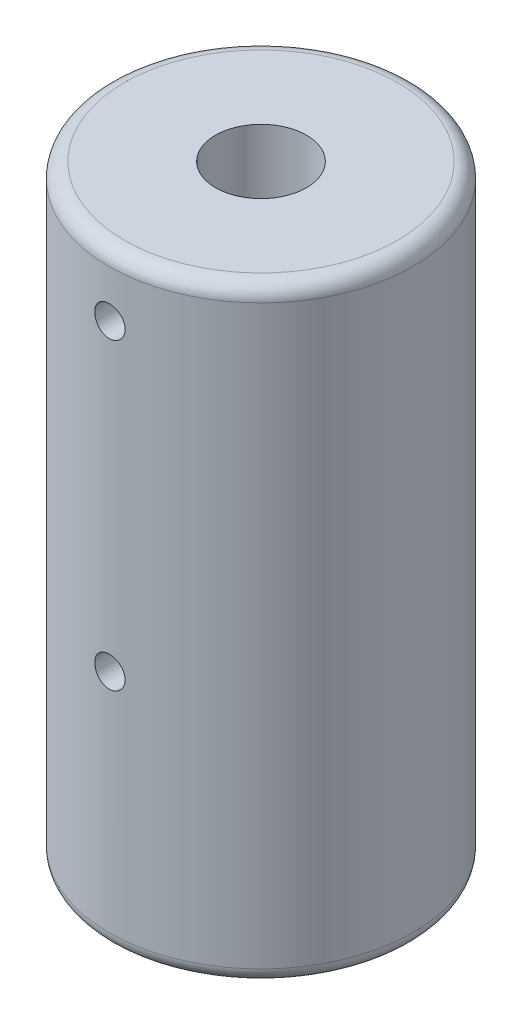
ISO-10303-21;
HEADER;
FILE_DESCRIPTION(('STEP AP214'),'2;1');
FILE_NAME('part.step','',(''),(''),'','','');
FILE_SCHEMA(('AUTOMOTIVE_DESIGN { 1 0 10303 214 1 1 1 1 }'));
ENDSEC;
DATA;
#1=APPLICATION_CONTEXT('core data for automotive mechanical design processes');
#2=APPLICATION_PROTOCOL_DEFINITION('international standard','automotive_design',2000,#1);
#3=PRODUCT_CONTEXT('',#1,'mechanical');
#4=PRODUCT('Part','Part','',(#3));
#5=PRODUCT_RELATED_PRODUCT_CATEGORY('part','',(#4));
#6=PRODUCT_DEFINITION_FORMATION('','',#4);
#7=PRODUCT_DEFINITION_CONTEXT('part definition',#1,'design');
#8=PRODUCT_DEFINITION('design','',#6,#7);
#9=PRODUCT_DEFINITION_SHAPE('','',#8);
#10=(LENGTH_UNIT() NAMED_UNIT(*) SI_UNIT(.MILLI.,.METRE.));
#11=(NAMED_UNIT(*) PLANE_ANGLE_UNIT() SI_UNIT($,.RADIAN.));
#12=(NAMED_UNIT(*) SI_UNIT($,.STERADIAN.) SOLID_ANGLE_UNIT());
#13=UNCERTAINTY_MEASURE_WITH_UNIT(LENGTH_MEASURE(1.E-05),#10,'distance_accuracy_value','');
#14=(GEOMETRIC_REPRESENTATION_CONTEXT(3) GLOBAL_UNCERTAINTY_ASSIGNED_CONTEXT((#13)) GLOBAL_UNIT_ASSIGNED_CONTEXT((#10,
#11,#12)) REPRESENTATION_CONTEXT('',''));
#15=CARTESIAN_POINT('',(0.,0.,0.));
#16=DIRECTION('',(0.,0.,1.));
#17=DIRECTION('',(1.,0.,0.));
#18=AXIS2_PLACEMENT_3D('',#15,#16,#17);
#19=CARTESIAN_POINT('',(0.,1.,0.));
#20=DIRECTION('',(0.,1.,0.));
#21=DIRECTION('',(0.,0.,1.));
#22=AXIS2_PLACEMENT_3D('',#19,#20,#21);
#23=TOROIDAL_SURFACE('',#22,9.,1.);
#24=CARTESIAN_POINT('',(0.,1.,0.));
#25=DIRECTION('',(0.,1.,0.));
#26=DIRECTION('',(0.,0.,1.));
#27=AXIS2_PLACEMENT_3D('',#24,#25,#26);
#28=CIRCLE('',#27,10.);
#29=CARTESIAN_POINT('',(0.,1.,10.));
#30=VERTEX_POINT('',#29);
#31=EDGE_CURVE('E39',#30,#30,#28,.T.);
#32=ORIENTED_EDGE('',*,*,#31,.F.);
#33=EDGE_LOOP('',(#32));
#34=FACE_BOUND('',#33,.T.);
#35=CARTESIAN_POINT('',(0.,0.,0.));
#36=DIRECTION('',(0.,1.,0.));
#37=DIRECTION('',(0.,0.,1.));
#38=AXIS2_PLACEMENT_3D('',#35,#36,#37);
#39=CIRCLE('',#38,9.);
#40=CARTESIAN_POINT('',(0.,0.,9.));
#41=VERTEX_POINT('',#40);
#42=EDGE_CURVE('E10',#41,#41,#39,.F.);
#43=ORIENTED_EDGE('',*,*,#42,.F.);
#44=EDGE_LOOP('',(#43));
#45=FACE_BOUND('',#44,.T.);
#46=ADVANCED_FACE('F33',(#34,#45),#23,.T.);
#47=CARTESIAN_POINT('',(0.,39.,0.));
#48=DIRECTION('',(0.,1.,0.));
#49=DIRECTION('',(0.,0.,1.));
#50=AXIS2_PLACEMENT_3D('',#47,#48,#49);
#51=TOROIDAL_SURFACE('',#50,9.,1.);
#52=CARTESIAN_POINT('',(0.,40.,0.));
#53=DIRECTION('',(0.,1.,0.));
#54=DIRECTION('',(0.,0.,1.));
#55=AXIS2_PLACEMENT_3D('',#52,#53,#54);
#56=CIRCLE('',#55,9.);
#57=CARTESIAN_POINT('',(0.,40.,9.));
#58=VERTEX_POINT('',#57);
#59=EDGE_CURVE('E47',#58,#58,#56,.T.);
#60=ORIENTED_EDGE('',*,*,#59,.F.);
#61=EDGE_LOOP('',(#60));
#62=FACE_BOUND('',#61,.T.);
#63=CARTESIAN_POINT('',(0.,39.,0.));
#64=DIRECTION('',(0.,1.,0.));
#65=DIRECTION('',(0.,0.,1.));
#66=AXIS2_PLACEMENT_3D('',#63,#64,#65);
#67=CIRCLE('',#66,10.);
#68=CARTESIAN_POINT('',(0.,39.,10.));
#69=VERTEX_POINT('',#68);
#70=EDGE_CURVE('E43',#69,#69,#67,.F.);
#71=ORIENTED_EDGE('',*,*,#70,.F.);
#72=EDGE_LOOP('',(#71));
#73=FACE_BOUND('',#72,.T.);
#74=ADVANCED_FACE('F88',(#62,#73),#51,.T.);
#75=CARTESIAN_POINT('',(0.,40.,0.));
#76=DIRECTION('',(0.,-1.,0.));
#77=DIRECTION('',(0.,0.,-1.));
#78=AXIS2_PLACEMENT_3D('',#75,#76,#77);
#79=CYLINDRICAL_SURFACE('',#78,10.);
#80=CARTESIAN_POINT('',(1.,15.8934017674891,9.9498743710662));
#81=CARTESIAN_POINT('',(0.999997573393512,15.9494213316627,9.94987502796903));
#82=CARTESIAN_POINT('',(0.995276858982476,16.005477935901,9.95035256994218));
#83=CARTESIAN_POINT('',(0.976516314763562,16.1160369537827,9.95221087558119));
#84=CARTESIAN_POINT('',(0.962466214886436,16.1705375855266,9.95359263461219));
#85=CARTESIAN_POINT('',(0.925460116068927,16.276367586707,9.95710133047387));
#86=CARTESIAN_POINT('',(0.9025095162939,16.3276988568806,9.9592278154679));
#87=CARTESIAN_POINT('',(0.848364267391103,16.4257695597809,9.9639858057182));
#88=CARTESIAN_POINT('',(0.817171255625927,16.4725099019728,9.96661721064329));
#89=CARTESIAN_POINT('',(0.747304761998705,16.5602530311466,9.97209926709899));
#90=CARTESIAN_POINT('',(0.70860741810826,16.6012367769929,9.97495060005266));
#91=CARTESIAN_POINT('',(0.624881715319564,16.6761393764927,9.98054505235719));
#92=CARTESIAN_POINT('',(0.579853066906569,16.7100579068954,9.98328816675213));
#93=CARTESIAN_POINT('',(0.484626361650987,16.7699330244963,9.98836383155605));
#94=CARTESIAN_POINT('',(0.434417662529568,16.7958727662828,9.99069550894647));
#95=CARTESIAN_POINT('',(0.330329984287509,16.8389462006378,9.9946781687577));
#96=CARTESIAN_POINT('',(0.276451094668218,16.8560801078586,9.99632916777064));
#97=CARTESIAN_POINT('',(0.166744782742949,16.8809996768424,9.99875966571026));
#98=CARTESIAN_POINT('',(0.110924527031581,16.8888166002391,9.99954207842817));
#99=CARTESIAN_POINT('',(-0.00124074068894316,16.8949770366228,10.0001571559869));
#100=CARTESIAN_POINT('',(-0.057585739054461,16.8933207952354,9.99998984545273));
#101=CARTESIAN_POINT('',(-0.168988844064559,16.880607294839,9.99872671311186));
#102=CARTESIAN_POINT('',(-0.224050829934978,16.8695836519252,9.99763421151713));
#103=CARTESIAN_POINT('',(-0.331539179504532,16.8385006385425,9.9946472926493));
#104=CARTESIAN_POINT('',(-0.383965508957728,16.8184411507016,9.99275286495953));
#105=CARTESIAN_POINT('',(-0.484800314679587,16.7698190042347,9.98836937483915));
#106=CARTESIAN_POINT('',(-0.533201570981651,16.741241469959,9.98587927365758));
#107=CARTESIAN_POINT('',(-0.624533513174195,16.6764052441528,9.98058384519407));
#108=CARTESIAN_POINT('',(-0.667464038560828,16.6401463273439,9.97777850866811));
#109=CARTESIAN_POINT('',(-0.746832771822688,16.5607875379755,9.97215293467852));
#110=CARTESIAN_POINT('',(-0.783241746190342,16.5176584227475,9.96933268573028));
#111=CARTESIAN_POINT('',(-0.848307535357915,16.4258849022783,9.96400739928222));
#112=CARTESIAN_POINT('',(-0.876964338912889,16.377240489037,9.96150236223964));
#113=CARTESIAN_POINT('',(-0.92571218457323,16.2757947422893,9.95709089514149));
#114=CARTESIAN_POINT('',(-0.945801420572959,16.2229925350662,9.95518459132555));
#115=CARTESIAN_POINT('',(-0.976820735637589,16.1147411628744,9.95218901870938));
#116=CARTESIAN_POINT('',(-0.987751093743034,16.0592920786017,9.95109972501768));
#117=CARTESIAN_POINT('',(-1.00010477539196,15.9475775879596,9.94986580527417));
#118=CARTESIAN_POINT('',(-1.00156899664721,15.8913167472243,9.94971711547603));
#119=CARTESIAN_POINT('',(-0.995056246871362,15.7793505016663,9.95037051354771));
#120=CARTESIAN_POINT('',(-0.987079403409754,15.7236450893488,9.95117258857061));
#121=CARTESIAN_POINT('',(-0.96194517450752,15.6144901852108,9.95363344422402));
#122=CARTESIAN_POINT('',(-0.944807127188908,15.5610361963945,9.95529042001345));
#123=CARTESIAN_POINT('',(-0.901856719675939,15.4577617157588,9.95927291038794));
#124=CARTESIAN_POINT('',(-0.876044160783588,15.4079413072019,9.9615984402867));
#125=CARTESIAN_POINT('',(-0.816375001423217,15.3131617934603,9.96666584355714));
#126=CARTESIAN_POINT('',(-0.78249129984069,15.2682198255229,9.96940910814672));
#127=CARTESIAN_POINT('',(-0.707680533451173,15.1846467142151,9.97499832625186));
#128=CARTESIAN_POINT('',(-0.666753294248134,15.146015727149,9.97784428230866));
#129=CARTESIAN_POINT('',(-0.578839804226474,15.076020134091,9.98333047849302));
#130=CARTESIAN_POINT('',(-0.531832255969452,15.0446822079029,9.98596994055474));
#131=CARTESIAN_POINT('',(-0.433197717417131,14.9903458989827,9.99073442106631));
#132=CARTESIAN_POINT('',(-0.381570790429626,14.967347401982,9.99285944656492));
#133=CARTESIAN_POINT('',(-0.275256126432816,14.9303879998338,9.99635210414006));
#134=CARTESIAN_POINT('',(-0.22057403764996,14.9164109801639,9.99772108605649));
#135=CARTESIAN_POINT('',(-0.109624813983679,14.8978386979093,9.99955294613649));
#136=CARTESIAN_POINT('',(-0.0533577236922179,14.8932431716551,10.0000158497656));
#137=CARTESIAN_POINT('',(0.0589022240757465,14.8935680339291,9.99998338313269));
#138=CARTESIAN_POINT('',(0.114895207224528,14.8984470043258,9.99949218376669));
#139=CARTESIAN_POINT('',(0.225261888356363,14.9174955131461,9.99761493577591));
#140=CARTESIAN_POINT('',(0.279635585068365,14.9316650588621,9.99622888644873));
#141=CARTESIAN_POINT('',(0.385219908767743,14.9688810248821,9.99271723813962));
#142=CARTESIAN_POINT('',(0.436430966077529,14.9919262344233,9.99059174003249));
#143=CARTESIAN_POINT('',(0.534264600154796,15.0462349364061,9.98583812416296));
#144=CARTESIAN_POINT('',(0.580887203768559,15.0774983807602,9.98321000934154));
#145=CARTESIAN_POINT('',(0.668432724426939,15.1475113865129,9.97773184669055));
#146=CARTESIAN_POINT('',(0.709330926219341,15.1862917837339,9.97488091460699));
#147=CARTESIAN_POINT('',(0.784057759393143,15.2701771190346,9.96928590769659));
#148=CARTESIAN_POINT('',(0.817884691847848,15.3152835726582,9.96654185867777));
#149=CARTESIAN_POINT('',(0.877576640424053,15.410666109409,9.96146383410601));
#150=CARTESIAN_POINT('',(0.903421187994835,15.4609550488132,9.95913091925306));
#151=CARTESIAN_POINT('',(0.94626470809877,15.5651500587354,9.95515194762462));
#152=CARTESIAN_POINT('',(0.963273657889858,15.6190519714148,9.95350511653359));
#153=CARTESIAN_POINT('',(0.98372168833353,15.7099495083882,9.95150007538145));
#154=CARTESIAN_POINT('',(0.989817712398225,15.7463640187956,9.95089331935694));
#155=CARTESIAN_POINT('',(0.997957658605114,15.8196475905317,9.95008025177663));
#156=CARTESIAN_POINT('',(1.00000159775726,15.8565166499517,9.94987393853984));
#157=CARTESIAN_POINT('',(1.,15.8934017674891,9.9498743710662));
#158=B_SPLINE_CURVE_WITH_KNOTS('',3,(#80,#81,#82,#83,#84,#85,#86,#87,#88,#89,#90,#91,#92,#93,
#94,#95,#96,#97,#98,#99,#100,#101,#102,#103,#104,#105,#106,#107,#108,#109,#110,#111,#112,#113,
#114,#115,#116,#117,#118,#119,#120,#121,#122,#123,#124,#125,#126,#127,#128,#129,#130,#131,#132,
#133,#134,#135,#136,#137,#138,#139,#140,#141,#142,#143,#144,#145,#146,#147,#148,#149,#150,#151,
#152,#153,#154,#155,#156,#157),.UNSPECIFIED.,.T.,.F.,(4,2,2,2,2,2,2,2,2,2,2,2,2,2,2,2,2,2,2,2,2,
2,2,2,2,2,2,2,2,2,2,2,2,2,2,2,2,2,4),(0.,0.16792399443646,0.336033151821769,0.504040490997471,
0.672014480421312,0.84053161529925,1.00905645855253,1.17793469971292,1.34680882407795,
1.5151147089845,1.68341622998232,1.85111631818661,2.01881858480974,2.18681545466414,
2.35481725218529,2.52355425085001,2.69229149427563,2.86106429117934,3.02983194595033,
3.19786996307766,3.3659057096687,3.53358814704527,3.70127442561047,3.86953189811718,
4.03779353723203,4.20666136818118,4.37552688518005,4.54408992694361,4.71264823113149,
4.88047133468483,5.04829456996659,5.21609491995246,5.38389428810799,5.55239715037989,
5.72094045034525,5.88991241070477,6.05869314894001,6.16926027606047,6.27982693903815),.UNSPECIFIED.);
#159=CARTESIAN_POINT('',(1.,15.8934017674891,9.9498743710662));
#160=VERTEX_POINT('',#159);
#161=EDGE_CURVE('E160',#160,#160,#158,.T.);
#162=ORIENTED_EDGE('',*,*,#161,.F.);
#163=EDGE_LOOP('',(#162));
#164=FACE_BOUND('',#163,.T.);
#165=CARTESIAN_POINT('',(0.999999999999998,35.8934017674891,9.9498743710662));
#166=CARTESIAN_POINT('',(0.99999757339351,35.9494213316627,9.94987502796903));
#167=CARTESIAN_POINT('',(0.995276858982474,36.005477935901,9.95035256994218));
#168=CARTESIAN_POINT('',(0.976516314763561,36.1160369537827,9.95221087558119));
#169=CARTESIAN_POINT('',(0.962466214886434,36.1705375855266,9.95359263461219));
#170=CARTESIAN_POINT('',(0.925460116068925,36.276367586707,9.95710133047387));
#171=CARTESIAN_POINT('',(0.902509516293898,36.3276988568806,9.9592278154679));
#172=CARTESIAN_POINT('',(0.848364267391099,36.4257695597809,9.9639858057182));
#173=CARTESIAN_POINT('',(0.817171255625923,36.4725099019728,9.96661721064329));
#174=CARTESIAN_POINT('',(0.7473047619987,36.5602530311466,9.97209926709899));
#175=CARTESIAN_POINT('',(0.708607418108256,36.6012367769929,9.97495060005266));
#176=CARTESIAN_POINT('',(0.624881715319563,36.6761393764927,9.98054505235719));
#177=CARTESIAN_POINT('',(0.579853066906568,36.7100579068954,9.98328816675213));
#178=CARTESIAN_POINT('',(0.484626361650988,36.7699330244963,9.98836383155605));
#179=CARTESIAN_POINT('',(0.43441766252957,36.7958727662828,9.99069550894647));
#180=CARTESIAN_POINT('',(0.330329984287512,36.8389462006378,9.9946781687577));
#181=CARTESIAN_POINT('',(0.276451094668221,36.8560801078586,9.99632916777064));
#182=CARTESIAN_POINT('',(0.166744782742952,36.8809996768424,9.99875966571026));
#183=CARTESIAN_POINT('',(0.110924527031584,36.8888166002391,9.99954207842817));
#184=CARTESIAN_POINT('',(-0.00124074068894171,36.8949770366228,10.0001571559869));
#185=CARTESIAN_POINT('',(-0.0575857390544602,36.8933207952354,9.99998984545273));
#186=CARTESIAN_POINT('',(-0.168988844064559,36.880607294839,9.99872671311186));
#187=CARTESIAN_POINT('',(-0.224050829934977,36.8695836519252,9.99763421151713));
#188=CARTESIAN_POINT('',(-0.331539179504531,36.8385006385425,9.9946472926493));
#189=CARTESIAN_POINT('',(-0.383965508957726,36.8184411507016,9.99275286495953));
#190=CARTESIAN_POINT('',(-0.484800314679585,36.7698190042347,9.98836937483915));
#191=CARTESIAN_POINT('',(-0.533201570981649,36.741241469959,9.98587927365758));
#192=CARTESIAN_POINT('',(-0.624533513174193,36.6764052441528,9.98058384519407));
#193=CARTESIAN_POINT('',(-0.667464038560826,36.6401463273439,9.97777850866811));
#194=CARTESIAN_POINT('',(-0.746832771822688,36.5607875379755,9.97215293467852));
#195=CARTESIAN_POINT('',(-0.783241746190345,36.5176584227475,9.96933268573028));
#196=CARTESIAN_POINT('',(-0.848307535357919,36.4258849022783,9.96400739928222));
#197=CARTESIAN_POINT('',(-0.87696433891289,36.377240489037,9.96150236223964));
#198=CARTESIAN_POINT('',(-0.925712184573229,36.2757947422893,9.95709089514149));
#199=CARTESIAN_POINT('',(-0.945801420572958,36.2229925350662,9.95518459132554));
#200=CARTESIAN_POINT('',(-0.976820735637587,36.1147411628744,9.95218901870938));
#201=CARTESIAN_POINT('',(-0.987751093743031,36.0592920786017,9.95109972501768));
#202=CARTESIAN_POINT('',(-1.00010477539196,35.9475775879596,9.94986580527417));
#203=CARTESIAN_POINT('',(-1.00156899664721,35.8913167472243,9.94971711547603));
#204=CARTESIAN_POINT('',(-0.99505624687136,35.7793505016663,9.95037051354771));
#205=CARTESIAN_POINT('',(-0.987079403409752,35.7236450893488,9.95117258857061));
#206=CARTESIAN_POINT('',(-0.961945174507518,35.6144901852108,9.95363344422402));
#207=CARTESIAN_POINT('',(-0.944807127188908,35.5610361963945,9.95529042001345));
#208=CARTESIAN_POINT('',(-0.90185671967594,35.4577617157588,9.95927291038795));
#209=CARTESIAN_POINT('',(-0.876044160783588,35.407941307202,9.9615984402867));
#210=CARTESIAN_POINT('',(-0.816375001423216,35.3131617934603,9.96666584355714));
#211=CARTESIAN_POINT('',(-0.782491299840689,35.2682198255229,9.96940910814672));
#212=CARTESIAN_POINT('',(-0.707680533451172,35.1846467142151,9.97499832625186));
#213=CARTESIAN_POINT('',(-0.666753294248132,35.146015727149,9.97784428230866));
#214=CARTESIAN_POINT('',(-0.578839804226472,35.076020134091,9.98333047849302));
#215=CARTESIAN_POINT('',(-0.531832255969451,35.0446822079029,9.98596994055474));
#216=CARTESIAN_POINT('',(-0.433197717417129,34.9903458989827,9.99073442106631));
#217=CARTESIAN_POINT('',(-0.381570790429622,34.967347401982,9.99285944656492));
#218=CARTESIAN_POINT('',(-0.275256126432812,34.9303879998338,9.99635210414006));
#219=CARTESIAN_POINT('',(-0.220574037649958,34.9164109801639,9.99772108605649));
#220=CARTESIAN_POINT('',(-0.109624813983679,34.8978386979093,9.99955294613649));
#221=CARTESIAN_POINT('',(-0.0533577236922175,34.8932431716551,10.0000158497656));
#222=CARTESIAN_POINT('',(0.0589022240757458,34.8935680339291,9.99998338313269));
#223=CARTESIAN_POINT('',(0.114895207224527,34.8984470043258,9.99949218376669));
#224=CARTESIAN_POINT('',(0.225261888356361,34.9174955131461,9.99761493577591));
#225=CARTESIAN_POINT('',(0.279635585068364,34.9316650588621,9.99622888644873));
#226=CARTESIAN_POINT('',(0.385219908767742,34.9688810248821,9.99271723813962));
#227=CARTESIAN_POINT('',(0.436430966077528,34.9919262344233,9.99059174003249));
#228=CARTESIAN_POINT('',(0.534264600154795,35.0462349364061,9.98583812416296));
#229=CARTESIAN_POINT('',(0.580887203768557,35.0774983807602,9.98321000934155));
#230=CARTESIAN_POINT('',(0.668432724426937,35.1475113865129,9.97773184669055));
#231=CARTESIAN_POINT('',(0.709330926219341,35.1862917837339,9.97488091460699));
#232=CARTESIAN_POINT('',(0.784057759393143,35.2701771190346,9.96928590769658));
#233=CARTESIAN_POINT('',(0.817884691847847,35.3152835726582,9.96654185867777));
#234=CARTESIAN_POINT('',(0.877576640424051,35.410666109409,9.96146383410601));
#235=CARTESIAN_POINT('',(0.903421187994832,35.4609550488132,9.95913091925306));
#236=CARTESIAN_POINT('',(0.946264708098765,35.5651500587354,9.95515194762462));
#237=CARTESIAN_POINT('',(0.963273657889855,35.6190519714148,9.95350511653359));
#238=CARTESIAN_POINT('',(0.983721688333528,35.7099495083882,9.95150007538145));
#239=CARTESIAN_POINT('',(0.989817712398224,35.7463640187956,9.95089331935694));
#240=CARTESIAN_POINT('',(0.997957658605112,35.8196475905317,9.95008025177663));
#241=CARTESIAN_POINT('',(1.00000159775726,35.8565166499517,9.94987393853984));
#242=CARTESIAN_POINT('',(0.999999999999998,35.8934017674891,9.9498743710662));
#243=B_SPLINE_CURVE_WITH_KNOTS('',3,(#165,#166,#167,#168,#169,#170,#171,#172,#173,#174,#175,
#176,#177,#178,#179,#180,#181,#182,#183,#184,#185,#186,#187,#188,#189,#190,#191,#192,#193,#194,
#195,#196,#197,#198,#199,#200,#201,#202,#203,#204,#205,#206,#207,#208,#209,#210,#211,#212,#213,
#214,#215,#216,#217,#218,#219,#220,#221,#222,#223,#224,#225,#226,#227,#228,#229,#230,#231,#232,
#233,#234,#235,#236,#237,#238,#239,#240,#241,#242),.UNSPECIFIED.,.T.,.F.,(4,2,2,2,2,2,2,2,2,2,2,
2,2,2,2,2,2,2,2,2,2,2,2,2,2,2,2,2,2,2,2,2,2,2,2,2,2,2,4),(0.,0.167923994436456,
0.336033151821769,0.504040490997474,0.672014480421317,0.840531615299247,1.00905645855253,
1.17793469971291,1.34680882407794,1.51511470898449,1.68341622998232,1.85111631818661,
2.01881858480974,2.18681545466413,2.35481725218528,2.52355425085002,2.69229149427562,
2.86106429117933,3.02983194595032,3.19786996307764,3.36590570966869,3.53358814704526,
3.70127442561047,3.86953189811718,4.03779353723202,4.20666136818118,4.37552688518004,
4.54408992694361,4.71264823113148,4.88047133468482,5.04829456996657,5.21609491995245,
5.38389428810798,5.55239715037988,5.72094045034524,5.88991241070475,6.05869314893999,
6.16926027606047,6.27982693903814),.UNSPECIFIED.);
#244=CARTESIAN_POINT('',(0.999999999999998,35.8934017674891,9.9498743710662));
#245=VERTEX_POINT('',#244);
#246=EDGE_CURVE('E56',#245,#245,#243,.T.);
#247=ORIENTED_EDGE('',*,*,#246,.F.);
#248=EDGE_LOOP('',(#247));
#249=FACE_BOUND('',#248,.T.);
#250=ORIENTED_EDGE('',*,*,#31,.T.);
#251=EDGE_LOOP('',(#250));
#252=FACE_BOUND('',#251,.T.);
#253=ORIENTED_EDGE('',*,*,#70,.T.);
#254=EDGE_LOOP('',(#253));
#255=FACE_BOUND('',#254,.T.);
#256=ADVANCED_FACE('F82',(#164,#249,#252,#255),#79,.T.);
#257=CARTESIAN_POINT('',(0.,40.,0.));
#258=DIRECTION('',(0.,1.,0.));
#259=DIRECTION('',(0.,0.,1.));
#260=AXIS2_PLACEMENT_3D('',#257,#258,#259);
#261=PLANE('',#260);
#262=CARTESIAN_POINT('',(0.,40.,0.));
#263=DIRECTION('',(0.,1.,0.));
#264=DIRECTION('',(0.,0.,1.));
#265=AXIS2_PLACEMENT_3D('',#262,#263,#264);
#266=CIRCLE('',#265,3.);
#267=CARTESIAN_POINT('',(0.,40.,3.));
#268=VERTEX_POINT('',#267);
#269=EDGE_CURVE('E53',#268,#268,#266,.T.);
#270=ORIENTED_EDGE('',*,*,#269,.F.);
#271=EDGE_LOOP('',(#270));
#272=FACE_BOUND('',#271,.T.);
#273=ORIENTED_EDGE('',*,*,#59,.T.);
#274=EDGE_LOOP('',(#273));
#275=FACE_BOUND('',#274,.T.);
#276=ADVANCED_FACE('F79',(#272,#275),#261,.T.);
#277=CARTESIAN_POINT('',(0.,0.,0.));
#278=DIRECTION('',(0.,1.,0.));
#279=DIRECTION('',(0.,0.,1.));
#280=AXIS2_PLACEMENT_3D('',#277,#278,#279);
#281=PLANE('',#280);
#282=CARTESIAN_POINT('',(0.,0.,0.));
#283=DIRECTION('',(0.,1.,0.));
#284=DIRECTION('',(0.,0.,1.));
#285=AXIS2_PLACEMENT_3D('',#282,#283,#284);
#286=CIRCLE('',#285,3.);
#287=CARTESIAN_POINT('',(0.,0.,3.));
#288=VERTEX_POINT('',#287);
#289=EDGE_CURVE('E52',#288,#288,#286,.T.);
#290=ORIENTED_EDGE('',*,*,#289,.T.);
#291=EDGE_LOOP('',(#290));
#292=FACE_BOUND('',#291,.T.);
#293=ORIENTED_EDGE('',*,*,#42,.T.);
#294=EDGE_LOOP('',(#293));
#295=FACE_BOUND('',#294,.T.);
#296=ADVANCED_FACE('F77',(#292,#295),#281,.F.);
#297=CARTESIAN_POINT('',(0.,0.,0.));
#298=DIRECTION('',(0.,1.,0.));
#299=DIRECTION('',(0.,0.,1.));
#300=AXIS2_PLACEMENT_3D('',#297,#298,#299);
#301=CYLINDRICAL_SURFACE('',#300,3.);
#302=CARTESIAN_POINT('',(1.,15.8934017674891,2.82842712474619));
#303=CARTESIAN_POINT('',(1.0000002579478,15.8389335926784,2.82842694532735));
#304=CARTESIAN_POINT('',(0.99553478369814,15.7844669677176,2.83001769372806));
#305=CARTESIAN_POINT('',(0.977851131702564,15.6771473465385,2.8361757417458));
#306=CARTESIAN_POINT('',(0.964631512170674,15.6242946176252,2.8407435316722));
#307=CARTESIAN_POINT('',(0.929955485680263,15.5217748744763,2.85228203663888));
#308=CARTESIAN_POINT('',(0.908515221402001,15.4721018380422,2.8592480396464));
#309=CARTESIAN_POINT('',(0.858061628442627,15.3770417189453,2.87479122017008));
#310=CARTESIAN_POINT('',(0.829046628860523,15.3316555849366,2.88336875305432));
#311=CARTESIAN_POINT('',(0.763051146442527,15.2446818051496,2.90154489405589));
#312=CARTESIAN_POINT('',(0.725824341377825,15.2032863388171,2.91116894844139));
#313=CARTESIAN_POINT('',(0.64498766721449,15.1271949662648,2.93013864801508));
#314=CARTESIAN_POINT('',(0.601376775052402,15.0925001359068,2.93948424829099));
#315=CARTESIAN_POINT('',(0.507604507964984,15.0299228701594,2.95713866921658));
#316=CARTESIAN_POINT('',(0.457301911224518,15.0022417968711,2.96541407701568));
#317=CARTESIAN_POINT('',(0.352431222987481,14.9558101823616,2.9796958677102));
#318=CARTESIAN_POINT('',(0.297864285687214,14.9370572343122,2.98570286203012));
#319=CARTESIAN_POINT('',(0.188028817433493,14.9096659128567,2.99459075431897));
#320=CARTESIAN_POINT('',(0.132850754852968,14.9006983212321,2.99757314777558));
#321=CARTESIAN_POINT('',(0.0216978748240917,14.8920854741285,3.00043608218249));
#322=CARTESIAN_POINT('',(-0.0342767335438921,14.8924378158367,3.00031742262891));
#323=CARTESIAN_POINT('',(-0.143103515193817,14.9022460220552,2.99706039618736));
#324=CARTESIAN_POINT('',(-0.195992048591666,14.9113442959636,2.99404064755135));
#325=CARTESIAN_POINT('',(-0.29944343882216,14.9377947484696,2.98546967339714));
#326=CARTESIAN_POINT('',(-0.350006137779175,14.9551474864689,2.97991827631115));
#327=CARTESIAN_POINT('',(-0.448152474842013,14.9978230847953,2.96675670293292));
#328=CARTESIAN_POINT('',(-0.495688220968998,15.0232477060359,2.9591204252427));
#329=CARTESIAN_POINT('',(-0.58592432552717,15.0812614729375,2.94258393038665));
#330=CARTESIAN_POINT('',(-0.62862333438477,15.1138526108158,2.93368336200518));
#331=CARTESIAN_POINT('',(-0.710100866551907,15.1870761609499,2.9150619185089));
#332=CARTESIAN_POINT('',(-0.748600157067557,15.2280149253346,2.90532215172667));
#333=CARTESIAN_POINT('',(-0.81827725959589,15.3158504932118,2.88647335245111));
#334=CARTESIAN_POINT('',(-0.849453943273005,15.3627482132024,2.8773644173145));
#335=CARTESIAN_POINT('',(-0.903987455042732,15.4620553931045,2.86070525135531));
#336=CARTESIAN_POINT('',(-0.927226463651049,15.5145338988569,2.85317909338821));
#337=CARTESIAN_POINT('',(-0.964443193299507,15.6229731617554,2.84081650878299));
#338=CARTESIAN_POINT('',(-0.97842479575553,15.6789324487109,2.83597895501223));
#339=CARTESIAN_POINT('',(-0.996161282090475,15.7900401228897,2.8297963630207));
#340=CARTESIAN_POINT('',(-1.00034909550575,15.8451111922348,2.82830360315139));
#341=CARTESIAN_POINT('',(-0.999605438911605,15.9551779166062,2.828566720628));
#342=CARTESIAN_POINT('',(-0.994675625227261,16.0101735835139,2.83032200792768));
#343=CARTESIAN_POINT('',(-0.97622565155183,16.1165587332003,2.83673618089379));
#344=CARTESIAN_POINT('',(-0.963006393980555,16.1680071976398,2.84129325440593));
#345=CARTESIAN_POINT('',(-0.928713862560597,16.2679453737285,2.8526855367127));
#346=CARTESIAN_POINT('',(-0.907639196363458,16.31643455908,2.85952114934907));
#347=CARTESIAN_POINT('',(-0.857474340738901,16.4107821883361,2.87496877595718));
#348=CARTESIAN_POINT('',(-0.828151118358487,16.4565084101309,2.8836302566561));
#349=CARTESIAN_POINT('',(-0.762585630557568,16.5425478198729,2.90165768730984));
#350=CARTESIAN_POINT('',(-0.726341325498784,16.5828594061503,2.91102384443799));
#351=CARTESIAN_POINT('',(-0.645891705900322,16.6589297515798,2.92995038637844));
#352=CARTESIAN_POINT('',(-0.601387270546651,16.694376157508,2.93949843577895));
#353=CARTESIAN_POINT('',(-0.506827291400258,16.7573179098372,2.9572685161311));
#354=CARTESIAN_POINT('',(-0.456771944864554,16.7848135386515,2.96549059417695));
#355=CARTESIAN_POINT('',(-0.352779862432297,16.8308218723508,2.97964405810603));
#356=CARTESIAN_POINT('',(-0.298871123321198,16.8493930446372,2.98559030004531));
#357=CARTESIAN_POINT('',(-0.188458465846017,16.8771295095492,2.99458610837774));
#358=CARTESIAN_POINT('',(-0.13195549195389,16.8862981973696,2.99763672034018));
#359=CARTESIAN_POINT('',(-0.0208153358600405,16.8946638450948,3.00041863236257));
#360=CARTESIAN_POINT('',(0.0337847239200191,16.8943092214215,3.00029920089441));
#361=CARTESIAN_POINT('',(0.142111145000173,16.8847444593427,2.99712196519396));
#362=CARTESIAN_POINT('',(0.195837576819054,16.8755350393364,2.99406439933567));
#363=CARTESIAN_POINT('',(0.30004211943206,16.8488195329132,2.98540914954421));
#364=CARTESIAN_POINT('',(0.350558270912794,16.8314475521362,2.9798525836118));
#365=CARTESIAN_POINT('',(0.447978350939789,16.789024236392,2.96677160704464));
#366=CARTESIAN_POINT('',(0.494881624142409,16.7639715122922,2.95924684047901));
#367=CARTESIAN_POINT('',(0.585634016308809,16.705832255387,2.94265868828001));
#368=CARTESIAN_POINT('',(0.629306251557698,16.6724830821072,2.93354872492381));
#369=CARTESIAN_POINT('',(0.71058102627234,16.5991443763332,2.91492988791425));
#370=CARTESIAN_POINT('',(0.74818162162426,16.5591527252274,2.90542088771397));
#371=CARTESIAN_POINT('',(0.817741808833464,16.4717924119011,2.88663279827365));
#372=CARTESIAN_POINT('',(0.849422965999216,16.4241962565084,2.87737727995345));
#373=CARTESIAN_POINT('',(0.904314343299799,16.3240673405905,2.86060193316303));
#374=CARTESIAN_POINT('',(0.927526776814558,16.2715358744749,2.8530816513617));
#375=CARTESIAN_POINT('',(0.963843828206626,16.1654399434653,2.84101334230535));
#376=CARTESIAN_POINT('',(0.977357909163267,16.1120295039234,2.83634632944799));
#377=CARTESIAN_POINT('',(0.995434320161694,16.0035457169737,2.83005383613939));
#378=CARTESIAN_POINT('',(0.999999739196502,15.9484729500534,2.82842730615135));
#379=CARTESIAN_POINT('',(1.,15.8934017674891,2.82842712474619));
#380=B_SPLINE_CURVE_WITH_KNOTS('',3,(#302,#303,#304,#305,#306,#307,#308,#309,#310,#311,#312,
#313,#314,#315,#316,#317,#318,#319,#320,#321,#322,#323,#324,#325,#326,#327,#328,#329,#330,#331,
#332,#333,#334,#335,#336,#337,#338,#339,#340,#341,#342,#343,#344,#345,#346,#347,#348,#349,#350,
#351,#352,#353,#354,#355,#356,#357,#358,#359,#360,#361,#362,#363,#364,#365,#366,#367,#368,#369,
#370,#371,#372,#373,#374,#375,#376,#377,#378,#379),.UNSPECIFIED.,.T.,.F.,(4,2,2,2,2,2,2,2,2,2,2,
2,2,2,2,2,2,2,2,2,2,2,2,2,2,2,2,2,2,2,2,2,2,2,2,2,2,2,4),(0.,0.163200584775416,0.32642805496888,
0.489336627454545,0.652281166139158,0.821013374229398,0.989772651673596,1.16293506139029,
1.33605076382161,1.50314318760306,1.67019253297699,1.83069004820941,1.99119844184608,
2.15381654855707,2.31647991869394,2.48680174359289,2.65714979607478,2.82992639837376,
3.00263051349689,3.16754291357512,3.33242535830307,3.49164395761849,3.65089079140019,
3.81518857728788,3.97953485655201,4.15178808164166,4.32403518750605,4.49513791183924,
4.66617882997229,4.82918084670708,4.99216964002854,5.15256956033503,5.31299850756316,
5.47935519513707,5.64576504425705,5.81868902729217,5.99156778259939,6.15663212153685,
6.32163947179229),.UNSPECIFIED.);
#381=CARTESIAN_POINT('',(1.,15.8934017674891,2.82842712474619));
#382=VERTEX_POINT('',#381);
#383=EDGE_CURVE('E164',#382,#382,#380,.T.);
#384=ORIENTED_EDGE('',*,*,#383,.F.);
#385=EDGE_LOOP('',(#384));
#386=FACE_BOUND('',#385,.T.);
#387=CARTESIAN_POINT('',(0.999999999999998,35.8934017674891,2.82842712474619));
#388=CARTESIAN_POINT('',(1.0000002579478,35.8389335926785,2.82842694532735));
#389=CARTESIAN_POINT('',(0.995534783698138,35.7844669677176,2.83001769372806));
#390=CARTESIAN_POINT('',(0.977851131702562,35.6771473465385,2.8361757417458));
#391=CARTESIAN_POINT('',(0.964631512170672,35.6242946176252,2.8407435316722));
#392=CARTESIAN_POINT('',(0.929955485680261,35.5217748744763,2.85228203663888));
#393=CARTESIAN_POINT('',(0.908515221401998,35.4721018380422,2.85924803964641));
#394=CARTESIAN_POINT('',(0.858061628442625,35.3770417189453,2.87479122017008));
#395=CARTESIAN_POINT('',(0.82904662886052,35.3316555849366,2.88336875305432));
#396=CARTESIAN_POINT('',(0.763051146442525,35.2446818051496,2.90154489405589));
#397=CARTESIAN_POINT('',(0.725824341377824,35.2032863388171,2.91116894844139));
#398=CARTESIAN_POINT('',(0.64498766721449,35.1271949662648,2.93013864801508));
#399=CARTESIAN_POINT('',(0.601376775052403,35.0925001359068,2.93948424829099));
#400=CARTESIAN_POINT('',(0.507604507964988,35.0299228701595,2.95713866921658));
#401=CARTESIAN_POINT('',(0.457301911224523,35.0022417968711,2.96541407701568));
#402=CARTESIAN_POINT('',(0.352431222987485,34.9558101823616,2.9796958677102));
#403=CARTESIAN_POINT('',(0.297864285687217,34.9370572343122,2.98570286203012));
#404=CARTESIAN_POINT('',(0.188028817433493,34.9096659128567,2.99459075431897));
#405=CARTESIAN_POINT('',(0.132850754852968,34.9006983212321,2.99757314777558));
#406=CARTESIAN_POINT('',(0.0216978748240922,34.8920854741285,3.00043608218249));
#407=CARTESIAN_POINT('',(-0.0342767335438917,34.8924378158367,3.00031742262891));
#408=CARTESIAN_POINT('',(-0.143103515193816,34.9022460220552,2.99706039618736));
#409=CARTESIAN_POINT('',(-0.195992048591666,34.9113442959636,2.99404064755135));
#410=CARTESIAN_POINT('',(-0.299443438822159,34.9377947484696,2.98546967339714));
#411=CARTESIAN_POINT('',(-0.350006137779174,34.9551474864689,2.97991827631115));
#412=CARTESIAN_POINT('',(-0.448152474842012,34.9978230847953,2.96675670293292));
#413=CARTESIAN_POINT('',(-0.495688220968997,35.0232477060359,2.9591204252427));
#414=CARTESIAN_POINT('',(-0.585924325527168,35.0812614729375,2.94258393038665));
#415=CARTESIAN_POINT('',(-0.628623334384767,35.1138526108158,2.93368336200518));
#416=CARTESIAN_POINT('',(-0.710100866551904,35.1870761609499,2.9150619185089));
#417=CARTESIAN_POINT('',(-0.748600157067554,35.2280149253346,2.90532215172667));
#418=CARTESIAN_POINT('',(-0.818277259595888,35.3158504932118,2.88647335245111));
#419=CARTESIAN_POINT('',(-0.849453943273002,35.3627482132024,2.8773644173145));
#420=CARTESIAN_POINT('',(-0.903987455042729,35.4620553931045,2.86070525135531));
#421=CARTESIAN_POINT('',(-0.927226463651047,35.5145338988569,2.85317909338821));
#422=CARTESIAN_POINT('',(-0.964443193299505,35.6229731617554,2.84081650878299));
#423=CARTESIAN_POINT('',(-0.978424795755528,35.6789324487109,2.83597895501223));
#424=CARTESIAN_POINT('',(-0.996161282090473,35.7900401228897,2.8297963630207));
#425=CARTESIAN_POINT('',(-1.00034909550575,35.8451111922349,2.82830360315139));
#426=CARTESIAN_POINT('',(-0.999605438911603,35.9551779166062,2.82856672062801));
#427=CARTESIAN_POINT('',(-0.994675625227258,36.0101735835139,2.83032200792768));
#428=CARTESIAN_POINT('',(-0.976225651551829,36.1165587332003,2.83673618089379));
#429=CARTESIAN_POINT('',(-0.963006393980554,36.1680071976398,2.84129325440594));
#430=CARTESIAN_POINT('',(-0.928713862560595,36.2679453737285,2.8526855367127));
#431=CARTESIAN_POINT('',(-0.907639196363456,36.31643455908,2.85952114934907));
#432=CARTESIAN_POINT('',(-0.857474340738899,36.4107821883361,2.87496877595718));
#433=CARTESIAN_POINT('',(-0.828151118358487,36.4565084101309,2.8836302566561));
#434=CARTESIAN_POINT('',(-0.762585630557569,36.5425478198729,2.90165768730984));
#435=CARTESIAN_POINT('',(-0.726341325498784,36.5828594061503,2.91102384443799));
#436=CARTESIAN_POINT('',(-0.645891705900322,36.6589297515798,2.92995038637844));
#437=CARTESIAN_POINT('',(-0.60138727054665,36.694376157508,2.93949843577895));
#438=CARTESIAN_POINT('',(-0.506827291400256,36.7573179098372,2.9572685161311));
#439=CARTESIAN_POINT('',(-0.456771944864551,36.7848135386515,2.96549059417695));
#440=CARTESIAN_POINT('',(-0.352779862432294,36.8308218723508,2.97964405810603));
#441=CARTESIAN_POINT('',(-0.298871123321195,36.8493930446372,2.98559030004531));
#442=CARTESIAN_POINT('',(-0.188458465846015,36.8771295095492,2.99458610837774));
#443=CARTESIAN_POINT('',(-0.131955491953889,36.8862981973696,2.99763672034018));
#444=CARTESIAN_POINT('',(-0.0208153358600403,36.8946638450948,3.00041863236257));
#445=CARTESIAN_POINT('',(0.0337847239200191,36.8943092214215,3.00029920089441));
#446=CARTESIAN_POINT('',(0.142111145000173,36.8847444593427,2.99712196519396));
#447=CARTESIAN_POINT('',(0.195837576819055,36.8755350393364,2.99406439933567));
#448=CARTESIAN_POINT('',(0.300042119432059,36.8488195329132,2.98540914954421));
#449=CARTESIAN_POINT('',(0.350558270912792,36.8314475521362,2.9798525836118));
#450=CARTESIAN_POINT('',(0.447978350939786,36.789024236392,2.96677160704464));
#451=CARTESIAN_POINT('',(0.494881624142408,36.7639715122922,2.95924684047901));
#452=CARTESIAN_POINT('',(0.585634016308807,36.705832255387,2.94265868828001));
#453=CARTESIAN_POINT('',(0.629306251557694,36.6724830821072,2.93354872492381));
#454=CARTESIAN_POINT('',(0.710581026272336,36.5991443763332,2.91492988791425));
#455=CARTESIAN_POINT('',(0.748181621624256,36.5591527252274,2.90542088771397));
#456=CARTESIAN_POINT('',(0.817741808833461,36.4717924119011,2.88663279827365));
#457=CARTESIAN_POINT('',(0.849422965999214,36.4241962565084,2.87737727995345));
#458=CARTESIAN_POINT('',(0.904314343299797,36.3240673405905,2.86060193316303));
#459=CARTESIAN_POINT('',(0.927526776814557,36.2715358744749,2.8530816513617));
#460=CARTESIAN_POINT('',(0.963843828206625,36.1654399434653,2.84101334230535));
#461=CARTESIAN_POINT('',(0.977357909163266,36.1120295039234,2.83634632944799));
#462=CARTESIAN_POINT('',(0.995434320161692,36.0035457169736,2.8300538361394));
#463=CARTESIAN_POINT('',(0.9999997391965,35.9484729500534,2.82842730615135));
#464=CARTESIAN_POINT('',(0.999999999999998,35.8934017674891,2.82842712474619));
#465=B_SPLINE_CURVE_WITH_KNOTS('',3,(#387,#388,#389,#390,#391,#392,#393,#394,#395,#396,#397,
#398,#399,#400,#401,#402,#403,#404,#405,#406,#407,#408,#409,#410,#411,#412,#413,#414,#415,#416,
#417,#418,#419,#420,#421,#422,#423,#424,#425,#426,#427,#428,#429,#430,#431,#432,#433,#434,#435,
#436,#437,#438,#439,#440,#441,#442,#443,#444,#445,#446,#447,#448,#449,#450,#451,#452,#453,#454,
#455,#456,#457,#458,#459,#460,#461,#462,#463,#464),.UNSPECIFIED.,.T.,.F.,(4,2,2,2,2,2,2,2,2,2,2,
2,2,2,2,2,2,2,2,2,2,2,2,2,2,2,2,2,2,2,2,2,2,2,2,2,2,2,4),(0.,0.163200584775419,
0.326428054968878,0.489336627454543,0.65228116613916,0.821013374229399,0.989772651673585,
1.16293506139028,1.3360507638216,1.50314318760305,1.67019253297698,1.8306900482094,
1.99119844184608,2.15381654855706,2.31647991869393,2.48680174359289,2.65714979607477,
2.82992639837375,3.00263051349688,3.16754291357512,3.33242535830306,3.49164395761848,
3.65089079140018,3.81518857728786,3.97953485655199,4.15178808164164,4.32403518750604,
4.49513791183923,4.66617882997228,4.82918084670707,4.99216964002852,5.15256956033501,
5.31299850756314,5.47935519513705,5.64576504425703,5.81868902729216,5.99156778259938,
6.15663212153685,6.32163947179228),.UNSPECIFIED.);
#466=CARTESIAN_POINT('',(0.999999999999998,35.8934017674891,2.82842712474619));
#467=VERTEX_POINT('',#466);
#468=EDGE_CURVE('E65',#467,#467,#465,.T.);
#469=ORIENTED_EDGE('',*,*,#468,.F.);
#470=EDGE_LOOP('',(#469));
#471=FACE_BOUND('',#470,.T.);
#472=ORIENTED_EDGE('',*,*,#289,.F.);
#473=EDGE_LOOP('',(#472));
#474=FACE_BOUND('',#473,.T.);
#475=ORIENTED_EDGE('',*,*,#269,.T.);
#476=EDGE_LOOP('',(#475));
#477=FACE_BOUND('',#476,.T.);
#478=ADVANCED_FACE('F74',(#386,#471,#474,#477),#301,.F.);
#479=CARTESIAN_POINT('',(0.,35.8934017674891,-10.001));
#480=DIRECTION('',(0.,0.,1.));
#481=DIRECTION('',(1.,0.,0.));
#482=AXIS2_PLACEMENT_3D('',#479,#480,#481);
#483=CYLINDRICAL_SURFACE('',#482,0.999999999999998);
#484=ORIENTED_EDGE('',*,*,#468,.T.);
#485=EDGE_LOOP('',(#484));
#486=FACE_BOUND('',#485,.T.);
#487=ORIENTED_EDGE('',*,*,#246,.T.);
#488=EDGE_LOOP('',(#487));
#489=FACE_BOUND('',#488,.T.);
#490=ADVANCED_FACE('F70',(#486,#489),#483,.F.);
#491=CARTESIAN_POINT('',(0.,15.8934017674891,-10.001));
#492=DIRECTION('',(0.,0.,1.));
#493=DIRECTION('',(1.,0.,0.));
#494=AXIS2_PLACEMENT_3D('',#491,#492,#493);
#495=CYLINDRICAL_SURFACE('',#494,1.);
#496=ORIENTED_EDGE('',*,*,#383,.T.);
#497=EDGE_LOOP('',(#496));
#498=FACE_BOUND('',#497,.T.);
#499=ORIENTED_EDGE('',*,*,#161,.T.);
#500=EDGE_LOOP('',(#499));
#501=FACE_BOUND('',#500,.T.);
#502=ADVANCED_FACE('F139',(#498,#501),#495,.F.);
#503=CLOSED_SHELL('',(#46,#74,#256,#276,#296,#478,#490,#502));
#504=MANIFOLD_SOLID_BREP('B2',#503);
#505=ADVANCED_BREP_SHAPE_REPRESENTATION('',(#18,#504),#14);
#506=SHAPE_DEFINITION_REPRESENTATION(#9,#505);
ENDSEC;
END-ISO-10303-21;
